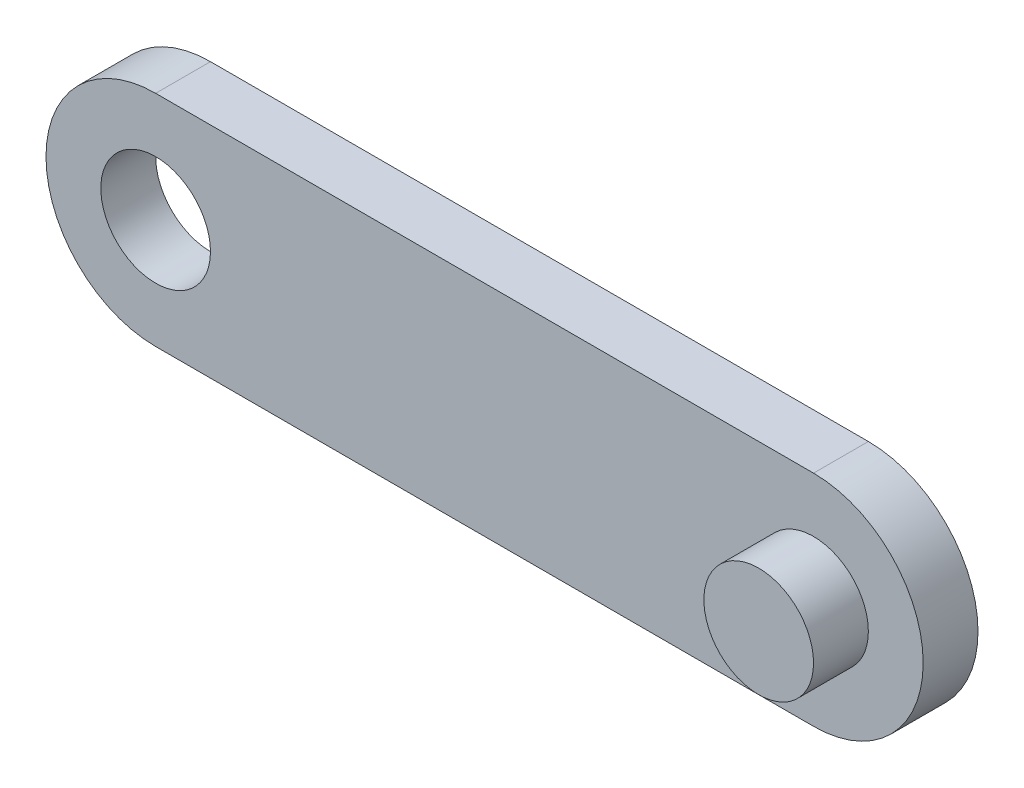
ISO-10303-21;
HEADER;
FILE_DESCRIPTION(('STEP AP214'),'2;1');
FILE_NAME('part.step','',(''),(''),'','','');
FILE_SCHEMA(('AUTOMOTIVE_DESIGN { 1 0 10303 214 1 1 1 1 }'));
ENDSEC;
DATA;
#1=APPLICATION_CONTEXT('core data for automotive mechanical design processes');
#2=APPLICATION_PROTOCOL_DEFINITION('international standard','automotive_design',2000,#1);
#3=PRODUCT_CONTEXT('',#1,'mechanical');
#4=PRODUCT('Part','Part','',(#3));
#5=PRODUCT_RELATED_PRODUCT_CATEGORY('part','',(#4));
#6=PRODUCT_DEFINITION_FORMATION('','',#4);
#7=PRODUCT_DEFINITION_CONTEXT('part definition',#1,'design');
#8=PRODUCT_DEFINITION('design','',#6,#7);
#9=PRODUCT_DEFINITION_SHAPE('','',#8);
#10=(LENGTH_UNIT() NAMED_UNIT(*) SI_UNIT(.MILLI.,.METRE.));
#11=(NAMED_UNIT(*) PLANE_ANGLE_UNIT() SI_UNIT($,.RADIAN.));
#12=(NAMED_UNIT(*) SI_UNIT($,.STERADIAN.) SOLID_ANGLE_UNIT());
#13=UNCERTAINTY_MEASURE_WITH_UNIT(LENGTH_MEASURE(1.E-05),#10,'distance_accuracy_value','');
#14=(GEOMETRIC_REPRESENTATION_CONTEXT(3) GLOBAL_UNCERTAINTY_ASSIGNED_CONTEXT((#13)) GLOBAL_UNIT_ASSIGNED_CONTEXT((#10,
#11,#12)) REPRESENTATION_CONTEXT('',''));
#15=CARTESIAN_POINT('',(0.,0.,0.));
#16=DIRECTION('',(0.,0.,1.));
#17=DIRECTION('',(1.,0.,0.));
#18=AXIS2_PLACEMENT_3D('',#15,#16,#17);
#19=CARTESIAN_POINT('',(-60.,0.,10.));
#20=DIRECTION('',(0.,0.,1.));
#21=DIRECTION('',(1.,0.,0.));
#22=AXIS2_PLACEMENT_3D('',#19,#20,#21);
#23=PLANE('',#22);
#24=CARTESIAN_POINT('',(-60.,0.,10.));
#25=DIRECTION('',(0.,0.,1.));
#26=DIRECTION('',(1.,0.,0.));
#27=AXIS2_PLACEMENT_3D('',#24,#25,#26);
#28=CIRCLE('',#27,10.);
#29=CARTESIAN_POINT('',(-50.,0.,10.));
#30=VERTEX_POINT('',#29);
#31=EDGE_CURVE('E110',#30,#30,#28,.T.);
#32=ORIENTED_EDGE('',*,*,#31,.F.);
#33=EDGE_LOOP('',(#32));
#34=FACE_BOUND('',#33,.T.);
#35=CARTESIAN_POINT('',(-60.,0.,10.));
#36=DIRECTION('',(0.,0.,1.));
#37=DIRECTION('',(1.,0.,0.));
#38=AXIS2_PLACEMENT_3D('',#35,#36,#37);
#39=CIRCLE('',#38,20.);
#40=CARTESIAN_POINT('',(-60.,20.,10.));
#41=VERTEX_POINT('',#40);
#42=CARTESIAN_POINT('',(-60.,-20.,10.));
#43=VERTEX_POINT('',#42);
#44=EDGE_CURVE('E95',#41,#43,#39,.T.);
#45=ORIENTED_EDGE('',*,*,#44,.T.);
#46=DIRECTION('',(1.,0.,0.));
#47=VECTOR('',#46,1.);
#48=CARTESIAN_POINT('',(-60.,-20.,10.));
#49=LINE('',#48,#47);
#50=CARTESIAN_POINT('',(60.,-20.,10.));
#51=VERTEX_POINT('',#50);
#52=EDGE_CURVE('E90',#43,#51,#49,.T.);
#53=ORIENTED_EDGE('',*,*,#52,.T.);
#54=CARTESIAN_POINT('',(60.,0.,10.));
#55=DIRECTION('',(0.,0.,1.));
#56=DIRECTION('',(1.,0.,0.));
#57=AXIS2_PLACEMENT_3D('',#54,#55,#56);
#58=CIRCLE('',#57,20.);
#59=CARTESIAN_POINT('',(60.,20.,10.));
#60=VERTEX_POINT('',#59);
#61=EDGE_CURVE('E93',#51,#60,#58,.T.);
#62=ORIENTED_EDGE('',*,*,#61,.T.);
#63=DIRECTION('',(-1.,0.,0.));
#64=VECTOR('',#63,1.);
#65=CARTESIAN_POINT('',(-60.,20.,10.));
#66=LINE('',#65,#64);
#67=EDGE_CURVE('E60',#60,#41,#66,.T.);
#68=ORIENTED_EDGE('',*,*,#67,.T.);
#69=EDGE_LOOP('',(#45,#53,#62,#68));
#70=FACE_BOUND('',#69,.T.);
#71=CARTESIAN_POINT('',(60.,0.,10.));
#72=DIRECTION('',(0.,0.,1.));
#73=DIRECTION('',(1.,0.,0.));
#74=AXIS2_PLACEMENT_3D('',#71,#72,#73);
#75=CIRCLE('',#74,9.99999999999999);
#76=CARTESIAN_POINT('',(70.,0.,10.));
#77=VERTEX_POINT('',#76);
#78=EDGE_CURVE('E124',#77,#77,#75,.T.);
#79=ORIENTED_EDGE('',*,*,#78,.F.);
#80=EDGE_LOOP('',(#79));
#81=FACE_BOUND('',#80,.T.);
#82=ADVANCED_FACE('F43',(#34,#70,#81),#23,.T.);
#83=CARTESIAN_POINT('',(-60.,0.,0.));
#84=DIRECTION('',(0.,0.,1.));
#85=DIRECTION('',(1.,0.,0.));
#86=AXIS2_PLACEMENT_3D('',#83,#84,#85);
#87=PLANE('',#86);
#88=CARTESIAN_POINT('',(-60.,0.,0.));
#89=DIRECTION('',(0.,0.,1.));
#90=DIRECTION('',(1.,0.,0.));
#91=AXIS2_PLACEMENT_3D('',#88,#89,#90);
#92=CIRCLE('',#91,10.);
#93=CARTESIAN_POINT('',(-50.,0.,0.));
#94=VERTEX_POINT('',#93);
#95=EDGE_CURVE('E121',#94,#94,#92,.T.);
#96=ORIENTED_EDGE('',*,*,#95,.T.);
#97=EDGE_LOOP('',(#96));
#98=FACE_BOUND('',#97,.T.);
#99=CARTESIAN_POINT('',(-60.,0.,0.));
#100=DIRECTION('',(0.,0.,1.));
#101=DIRECTION('',(1.,0.,0.));
#102=AXIS2_PLACEMENT_3D('',#99,#100,#101);
#103=CIRCLE('',#102,20.);
#104=CARTESIAN_POINT('',(-60.,20.,0.));
#105=VERTEX_POINT('',#104);
#106=CARTESIAN_POINT('',(-60.,-20.,0.));
#107=VERTEX_POINT('',#106);
#108=EDGE_CURVE('E107',#105,#107,#103,.T.);
#109=ORIENTED_EDGE('',*,*,#108,.F.);
#110=DIRECTION('',(-1.,0.,0.));
#111=VECTOR('',#110,1.);
#112=CARTESIAN_POINT('',(-60.,20.,0.));
#113=LINE('',#112,#111);
#114=CARTESIAN_POINT('',(60.,20.,0.));
#115=VERTEX_POINT('',#114);
#116=EDGE_CURVE('E83',#115,#105,#113,.T.);
#117=ORIENTED_EDGE('',*,*,#116,.F.);
#118=CARTESIAN_POINT('',(60.,0.,0.));
#119=DIRECTION('',(0.,0.,1.));
#120=DIRECTION('',(1.,0.,0.));
#121=AXIS2_PLACEMENT_3D('',#118,#119,#120);
#122=CIRCLE('',#121,20.);
#123=CARTESIAN_POINT('',(60.,-20.,0.));
#124=VERTEX_POINT('',#123);
#125=EDGE_CURVE('E77',#124,#115,#122,.T.);
#126=ORIENTED_EDGE('',*,*,#125,.F.);
#127=DIRECTION('',(1.,0.,0.));
#128=VECTOR('',#127,1.);
#129=CARTESIAN_POINT('',(-60.,-20.,0.));
#130=LINE('',#129,#128);
#131=EDGE_CURVE('E99',#107,#124,#130,.T.);
#132=ORIENTED_EDGE('',*,*,#131,.F.);
#133=EDGE_LOOP('',(#109,#117,#126,#132));
#134=FACE_BOUND('',#133,.T.);
#135=ADVANCED_FACE('F118',(#98,#134),#87,.F.);
#136=CARTESIAN_POINT('',(-60.,0.,10.));
#137=DIRECTION('',(0.,0.,-1.));
#138=DIRECTION('',(-1.,0.,0.));
#139=AXIS2_PLACEMENT_3D('',#136,#137,#138);
#140=CYLINDRICAL_SURFACE('',#139,20.);
#141=ORIENTED_EDGE('',*,*,#108,.T.);
#142=DIRECTION('',(0.,0.,-1.));
#143=VECTOR('',#142,1.);
#144=CARTESIAN_POINT('',(-60.,-20.,10.));
#145=LINE('',#144,#143);
#146=EDGE_CURVE('E13',#43,#107,#145,.T.);
#147=ORIENTED_EDGE('',*,*,#146,.F.);
#148=ORIENTED_EDGE('',*,*,#44,.F.);
#149=DIRECTION('',(0.,0.,-1.));
#150=VECTOR('',#149,1.);
#151=CARTESIAN_POINT('',(-60.,20.,10.));
#152=LINE('',#151,#150);
#153=EDGE_CURVE('E103',#41,#105,#152,.T.);
#154=ORIENTED_EDGE('',*,*,#153,.T.);
#155=EDGE_LOOP('',(#141,#147,#148,#154));
#156=FACE_BOUND('',#155,.T.);
#157=ADVANCED_FACE('F45',(#156),#140,.T.);
#158=CARTESIAN_POINT('',(-60.,-20.,10.));
#159=DIRECTION('',(0.,1.,0.));
#160=DIRECTION('',(-1.,0.,0.));
#161=AXIS2_PLACEMENT_3D('',#158,#159,#160);
#162=PLANE('',#161);
#163=ORIENTED_EDGE('',*,*,#131,.T.);
#164=DIRECTION('',(0.,0.,-1.));
#165=VECTOR('',#164,1.);
#166=CARTESIAN_POINT('',(60.,-20.,10.));
#167=LINE('',#166,#165);
#168=EDGE_CURVE('E52',#51,#124,#167,.T.);
#169=ORIENTED_EDGE('',*,*,#168,.F.);
#170=ORIENTED_EDGE('',*,*,#52,.F.);
#171=ORIENTED_EDGE('',*,*,#146,.T.);
#172=EDGE_LOOP('',(#163,#169,#170,#171));
#173=FACE_BOUND('',#172,.T.);
#174=ADVANCED_FACE('F98',(#173),#162,.F.);
#175=CARTESIAN_POINT('',(60.,0.,10.));
#176=DIRECTION('',(0.,0.,-1.));
#177=DIRECTION('',(-1.,0.,0.));
#178=AXIS2_PLACEMENT_3D('',#175,#176,#177);
#179=CYLINDRICAL_SURFACE('',#178,20.);
#180=ORIENTED_EDGE('',*,*,#125,.T.);
#181=DIRECTION('',(0.,0.,-1.));
#182=VECTOR('',#181,1.);
#183=CARTESIAN_POINT('',(60.,20.,10.));
#184=LINE('',#183,#182);
#185=EDGE_CURVE('E100',#60,#115,#184,.T.);
#186=ORIENTED_EDGE('',*,*,#185,.F.);
#187=ORIENTED_EDGE('',*,*,#61,.F.);
#188=ORIENTED_EDGE('',*,*,#168,.T.);
#189=EDGE_LOOP('',(#180,#186,#187,#188));
#190=FACE_BOUND('',#189,.T.);
#191=ADVANCED_FACE('F101',(#190),#179,.T.);
#192=CARTESIAN_POINT('',(-60.,20.,10.));
#193=DIRECTION('',(0.,-1.,0.));
#194=DIRECTION('',(1.,0.,0.));
#195=AXIS2_PLACEMENT_3D('',#192,#193,#194);
#196=PLANE('',#195);
#197=ORIENTED_EDGE('',*,*,#116,.T.);
#198=ORIENTED_EDGE('',*,*,#153,.F.);
#199=ORIENTED_EDGE('',*,*,#67,.F.);
#200=ORIENTED_EDGE('',*,*,#185,.T.);
#201=EDGE_LOOP('',(#197,#198,#199,#200));
#202=FACE_BOUND('',#201,.T.);
#203=ADVANCED_FACE('F115',(#202),#196,.F.);
#204=CARTESIAN_POINT('',(-60.,0.,10.));
#205=DIRECTION('',(0.,0.,-1.));
#206=DIRECTION('',(-1.,0.,0.));
#207=AXIS2_PLACEMENT_3D('',#204,#205,#206);
#208=CYLINDRICAL_SURFACE('',#207,10.);
#209=ORIENTED_EDGE('',*,*,#31,.T.);
#210=EDGE_LOOP('',(#209));
#211=FACE_BOUND('',#210,.T.);
#212=ORIENTED_EDGE('',*,*,#95,.F.);
#213=EDGE_LOOP('',(#212));
#214=FACE_BOUND('',#213,.T.);
#215=ADVANCED_FACE('F137',(#211,#214),#208,.F.);
#216=CARTESIAN_POINT('',(60.,0.,20.));
#217=DIRECTION('',(0.,0.,-1.));
#218=DIRECTION('',(-1.,0.,0.));
#219=AXIS2_PLACEMENT_3D('',#216,#217,#218);
#220=CYLINDRICAL_SURFACE('',#219,9.99999999999999);
#221=ORIENTED_EDGE('',*,*,#78,.T.);
#222=EDGE_LOOP('',(#221));
#223=FACE_BOUND('',#222,.T.);
#224=CARTESIAN_POINT('',(60.,0.,20.));
#225=DIRECTION('',(0.,0.,1.));
#226=DIRECTION('',(1.,0.,0.));
#227=AXIS2_PLACEMENT_3D('',#224,#225,#226);
#228=CIRCLE('',#227,9.99999999999999);
#229=CARTESIAN_POINT('',(70.,0.,20.));
#230=VERTEX_POINT('',#229);
#231=EDGE_CURVE('E129',#230,#230,#228,.T.);
#232=ORIENTED_EDGE('',*,*,#231,.F.);
#233=EDGE_LOOP('',(#232));
#234=FACE_BOUND('',#233,.T.);
#235=ADVANCED_FACE('F135',(#223,#234),#220,.T.);
#236=CARTESIAN_POINT('',(0.,0.,20.));
#237=DIRECTION('',(0.,0.,1.));
#238=DIRECTION('',(1.,0.,0.));
#239=AXIS2_PLACEMENT_3D('',#236,#237,#238);
#240=PLANE('',#239);
#241=ORIENTED_EDGE('',*,*,#231,.T.);
#242=EDGE_LOOP('',(#241));
#243=FACE_BOUND('',#242,.T.);
#244=ADVANCED_FACE('F133',(#243),#240,.T.);
#245=CLOSED_SHELL('',(#82,#135,#157,#174,#191,#203,#215,#235,#244));
#246=MANIFOLD_SOLID_BREP('B2',#245);
#247=ADVANCED_BREP_SHAPE_REPRESENTATION('',(#18,#246),#14);
#248=SHAPE_DEFINITION_REPRESENTATION(#9,#247);
ENDSEC;
END-ISO-10303-21;
